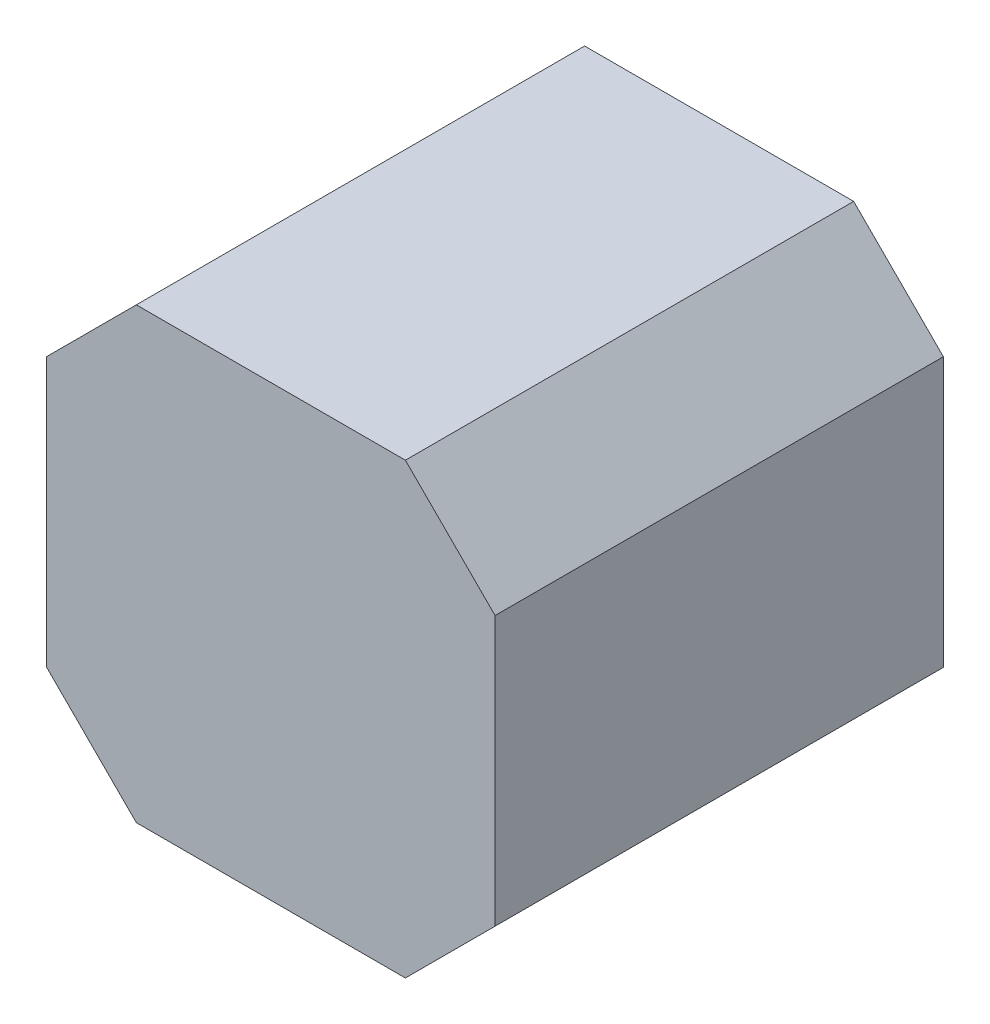
ISO-10303-21;
HEADER;
FILE_DESCRIPTION(('STEP AP214'),'2;1');
FILE_NAME('part.step','',(''),(''),'','','');
FILE_SCHEMA(('AUTOMOTIVE_DESIGN { 1 0 10303 214 1 1 1 1 }'));
ENDSEC;
DATA;
#1=APPLICATION_CONTEXT('core data for automotive mechanical design processes');
#2=APPLICATION_PROTOCOL_DEFINITION('international standard','automotive_design',2000,#1);
#3=PRODUCT_CONTEXT('',#1,'mechanical');
#4=PRODUCT('Part','Part','',(#3));
#5=PRODUCT_RELATED_PRODUCT_CATEGORY('part','',(#4));
#6=PRODUCT_DEFINITION_FORMATION('','',#4);
#7=PRODUCT_DEFINITION_CONTEXT('part definition',#1,'design');
#8=PRODUCT_DEFINITION('design','',#6,#7);
#9=PRODUCT_DEFINITION_SHAPE('','',#8);
#10=(LENGTH_UNIT() NAMED_UNIT(*) SI_UNIT(.MILLI.,.METRE.));
#11=(NAMED_UNIT(*) PLANE_ANGLE_UNIT() SI_UNIT($,.RADIAN.));
#12=(NAMED_UNIT(*) SI_UNIT($,.STERADIAN.) SOLID_ANGLE_UNIT());
#13=UNCERTAINTY_MEASURE_WITH_UNIT(LENGTH_MEASURE(1.E-05),#10,'distance_accuracy_value','');
#14=(GEOMETRIC_REPRESENTATION_CONTEXT(3) GLOBAL_UNCERTAINTY_ASSIGNED_CONTEXT((#13)) GLOBAL_UNIT_ASSIGNED_CONTEXT((#10,
#11,#12)) REPRESENTATION_CONTEXT('',''));
#15=CARTESIAN_POINT('',(0.,0.,0.));
#16=DIRECTION('',(0.,0.,1.));
#17=DIRECTION('',(1.,0.,0.));
#18=AXIS2_PLACEMENT_3D('',#15,#16,#17);
#19=CARTESIAN_POINT('',(-1.270508,-0.7622286,0.));
#20=DIRECTION('',(-1.,0.,0.));
#21=DIRECTION('',(0.,0.,1.));
#22=AXIS2_PLACEMENT_3D('',#19,#20,#21);
#23=PLANE('',#22);
#24=DIRECTION('',(0.,0.,1.));
#25=VECTOR('',#24,1.);
#26=CARTESIAN_POINT('',(-1.270508,0.76218796,0.));
#27=LINE('',#26,#25);
#28=CARTESIAN_POINT('',(-1.270508,0.76218796,0.));
#29=VERTEX_POINT('',#28);
#30=CARTESIAN_POINT('',(-1.270508,0.76218796,2.54));
#31=VERTEX_POINT('',#30);
#32=EDGE_CURVE('E159',#29,#31,#27,.T.);
#33=ORIENTED_EDGE('',*,*,#32,.F.);
#34=DIRECTION('',(0.,1.,0.));
#35=VECTOR('',#34,1.);
#36=CARTESIAN_POINT('',(-1.270508,-0.7622286,0.));
#37=LINE('',#36,#35);
#38=CARTESIAN_POINT('',(-1.270508,-0.7622286,0.));
#39=VERTEX_POINT('',#38);
#40=EDGE_CURVE('E92',#29,#39,#37,.F.);
#41=ORIENTED_EDGE('',*,*,#40,.T.);
#42=DIRECTION('',(0.,0.,1.));
#43=VECTOR('',#42,1.);
#44=CARTESIAN_POINT('',(-1.270508,-0.7622286,0.));
#45=LINE('',#44,#43);
#46=CARTESIAN_POINT('',(-1.270508,-0.7622286,2.54));
#47=VERTEX_POINT('',#46);
#48=EDGE_CURVE('E78',#47,#39,#45,.F.);
#49=ORIENTED_EDGE('',*,*,#48,.F.);
#50=DIRECTION('',(0.,1.,0.));
#51=VECTOR('',#50,1.);
#52=CARTESIAN_POINT('',(-1.270508,-0.7622286,2.54));
#53=LINE('',#52,#51);
#54=EDGE_CURVE('E68',#47,#31,#53,.T.);
#55=ORIENTED_EDGE('',*,*,#54,.T.);
#56=EDGE_LOOP('',(#33,#41,#49,#55));
#57=FACE_BOUND('',#56,.T.);
#58=ADVANCED_FACE('F17',(#57),#23,.T.);
#59=CARTESIAN_POINT('',(-1.270508,0.76218796,0.));
#60=DIRECTION('',(-0.707106781186548,0.707106781186548,0.));
#61=DIRECTION('',(-0.707106781186548,-0.707106781186548,0.));
#62=AXIS2_PLACEMENT_3D('',#59,#60,#61);
#63=PLANE('',#62);
#64=DIRECTION('',(0.,0.,1.));
#65=VECTOR('',#64,1.);
#66=CARTESIAN_POINT('',(-0.76220828,1.27048768,0.));
#67=LINE('',#66,#65);
#68=CARTESIAN_POINT('',(-0.76220828,1.27048768,0.));
#69=VERTEX_POINT('',#68);
#70=CARTESIAN_POINT('',(-0.76220828,1.27048768,2.54));
#71=VERTEX_POINT('',#70);
#72=EDGE_CURVE('E96',#69,#71,#67,.T.);
#73=ORIENTED_EDGE('',*,*,#72,.F.);
#74=DIRECTION('',(-0.707106781186548,-0.707106781186548,0.));
#75=VECTOR('',#74,1.);
#76=CARTESIAN_POINT('',(-1.270508,0.76218796,0.));
#77=LINE('',#76,#75);
#78=EDGE_CURVE('E85',#69,#29,#77,.T.);
#79=ORIENTED_EDGE('',*,*,#78,.T.);
#80=ORIENTED_EDGE('',*,*,#32,.T.);
#81=DIRECTION('',(-0.707106781186548,-0.707106781186548,0.));
#82=VECTOR('',#81,1.);
#83=CARTESIAN_POINT('',(-1.270508,0.76218796,2.54));
#84=LINE('',#83,#82);
#85=EDGE_CURVE('E91',#31,#71,#84,.F.);
#86=ORIENTED_EDGE('',*,*,#85,.T.);
#87=EDGE_LOOP('',(#73,#79,#80,#86));
#88=FACE_BOUND('',#87,.T.);
#89=ADVANCED_FACE('F169',(#88),#63,.T.);
#90=CARTESIAN_POINT('',(-0.76220828,-1.27052832,0.));
#91=DIRECTION('',(-0.707106781186548,-0.707106781186548,0.));
#92=DIRECTION('',(0.707106781186548,-0.707106781186548,0.));
#93=AXIS2_PLACEMENT_3D('',#90,#91,#92);
#94=PLANE('',#93);
#95=ORIENTED_EDGE('',*,*,#48,.T.);
#96=DIRECTION('',(0.707106781186548,-0.707106781186548,0.));
#97=VECTOR('',#96,1.);
#98=CARTESIAN_POINT('',(-0.76220828,-1.27052832,0.));
#99=LINE('',#98,#97);
#100=CARTESIAN_POINT('',(-0.76220828,-1.27052832,0.));
#101=VERTEX_POINT('',#100);
#102=EDGE_CURVE('E94',#39,#101,#99,.T.);
#103=ORIENTED_EDGE('',*,*,#102,.T.);
#104=DIRECTION('',(0.,0.,-1.));
#105=VECTOR('',#104,1.);
#106=CARTESIAN_POINT('',(-0.76220828,-1.27052832,0.));
#107=LINE('',#106,#105);
#108=CARTESIAN_POINT('',(-0.76220828,-1.27052832,2.54));
#109=VERTEX_POINT('',#108);
#110=EDGE_CURVE('E81',#109,#101,#107,.T.);
#111=ORIENTED_EDGE('',*,*,#110,.F.);
#112=DIRECTION('',(0.707106781186548,-0.707106781186548,0.));
#113=VECTOR('',#112,1.);
#114=CARTESIAN_POINT('',(-0.76220828,-1.27052832,2.54));
#115=LINE('',#114,#113);
#116=EDGE_CURVE('E75',#109,#47,#115,.F.);
#117=ORIENTED_EDGE('',*,*,#116,.T.);
#118=EDGE_LOOP('',(#95,#103,#111,#117));
#119=FACE_BOUND('',#118,.T.);
#120=ADVANCED_FACE('F76',(#119),#94,.T.);
#121=CARTESIAN_POINT('',(-0.76220828,1.27048768,0.));
#122=DIRECTION('',(7.83026645502871E-05,0.999999996934346,0.));
#123=DIRECTION('',(-0.999999996934346,7.83026645502871E-05,0.));
#124=AXIS2_PLACEMENT_3D('',#121,#122,#123);
#125=PLANE('',#124);
#126=DIRECTION('',(0.,0.,1.));
#127=VECTOR('',#126,1.);
#128=CARTESIAN_POINT('',(0.762327655226297,1.2703683047737,0.));
#129=LINE('',#128,#127);
#130=CARTESIAN_POINT('',(0.762343707192333,1.27034585939998,0.));
#131=VERTEX_POINT('',#130);
#132=CARTESIAN_POINT('',(0.762343707192333,1.27034585939998,2.54));
#133=VERTEX_POINT('',#132);
#134=EDGE_CURVE('E106',#131,#133,#129,.T.);
#135=ORIENTED_EDGE('',*,*,#134,.F.);
#136=DIRECTION('',(-0.999999996934346,7.83026645502871E-05,0.));
#137=VECTOR('',#136,1.);
#138=CARTESIAN_POINT('',(-0.76220828,1.27048768,0.));
#139=LINE('',#138,#137);
#140=EDGE_CURVE('E122',#131,#69,#139,.T.);
#141=ORIENTED_EDGE('',*,*,#140,.T.);
#142=ORIENTED_EDGE('',*,*,#72,.T.);
#143=DIRECTION('',(-0.999999996934346,7.83026645502871E-05,0.));
#144=VECTOR('',#143,1.);
#145=CARTESIAN_POINT('',(-0.76220828,1.27048768,2.54));
#146=LINE('',#145,#144);
#147=EDGE_CURVE('E144',#71,#133,#146,.F.);
#148=ORIENTED_EDGE('',*,*,#147,.T.);
#149=EDGE_LOOP('',(#135,#141,#142,#148));
#150=FACE_BOUND('',#149,.T.);
#151=ADVANCED_FACE('F172',(#150),#125,.T.);
#152=CARTESIAN_POINT('',(0.76220828,-1.27052832,0.));
#153=DIRECTION('',(0.,-1.,0.));
#154=DIRECTION('',(0.,0.,-1.));
#155=AXIS2_PLACEMENT_3D('',#152,#153,#154);
#156=PLANE('',#155);
#157=ORIENTED_EDGE('',*,*,#110,.T.);
#158=DIRECTION('',(1.,0.,0.));
#159=VECTOR('',#158,1.);
#160=CARTESIAN_POINT('',(0.76220828,-1.27052832,0.));
#161=LINE('',#160,#159);
#162=CARTESIAN_POINT('',(0.76220828,-1.27052832,0.));
#163=VERTEX_POINT('',#162);
#164=EDGE_CURVE('E108',#101,#163,#161,.T.);
#165=ORIENTED_EDGE('',*,*,#164,.T.);
#166=DIRECTION('',(0.,0.,1.));
#167=VECTOR('',#166,1.);
#168=CARTESIAN_POINT('',(0.76220828,-1.27052832,0.));
#169=LINE('',#168,#167);
#170=CARTESIAN_POINT('',(0.76220828,-1.27052832,2.54));
#171=VERTEX_POINT('',#170);
#172=EDGE_CURVE('E178',#171,#163,#169,.F.);
#173=ORIENTED_EDGE('',*,*,#172,.F.);
#174=DIRECTION('',(1.,0.,0.));
#175=VECTOR('',#174,1.);
#176=CARTESIAN_POINT('',(0.76238608,-1.27052832,2.54));
#177=LINE('',#176,#175);
#178=EDGE_CURVE('E113',#109,#171,#177,.T.);
#179=ORIENTED_EDGE('',*,*,#178,.F.);
#180=EDGE_LOOP('',(#157,#165,#173,#179));
#181=FACE_BOUND('',#180,.T.);
#182=ADVANCED_FACE('F193',(#181),#156,.T.);
#183=CARTESIAN_POINT('',(0.76238608,1.27030988,0.));
#184=DIRECTION('',(0.707106781186548,0.707106781186548,0.));
#185=DIRECTION('',(-0.707106781186548,0.707106781186548,0.));
#186=AXIS2_PLACEMENT_3D('',#183,#184,#185);
#187=PLANE('',#186);
#188=DIRECTION('',(0.,0.,-1.));
#189=VECTOR('',#188,1.);
#190=CARTESIAN_POINT('',(1.270508,0.76218796,0.));
#191=LINE('',#190,#189);
#192=CARTESIAN_POINT('',(1.270508,0.76218796,0.));
#193=VERTEX_POINT('',#192);
#194=CARTESIAN_POINT('',(1.270508,0.76218796,2.54));
#195=VERTEX_POINT('',#194);
#196=EDGE_CURVE('E127',#193,#195,#191,.F.);
#197=ORIENTED_EDGE('',*,*,#196,.F.);
#198=DIRECTION('',(-0.707106781186548,0.707106781186548,0.));
#199=VECTOR('',#198,1.);
#200=CARTESIAN_POINT('',(0.76238608,1.27030988,0.));
#201=LINE('',#200,#199);
#202=EDGE_CURVE('E35',#193,#131,#201,.T.);
#203=ORIENTED_EDGE('',*,*,#202,.T.);
#204=ORIENTED_EDGE('',*,*,#134,.T.);
#205=DIRECTION('',(-0.707106781186548,0.707106781186547,0.));
#206=VECTOR('',#205,1.);
#207=CARTESIAN_POINT('',(1.270508,0.76218796,2.54));
#208=LINE('',#207,#206);
#209=EDGE_CURVE('E173',#195,#133,#208,.T.);
#210=ORIENTED_EDGE('',*,*,#209,.F.);
#211=EDGE_LOOP('',(#197,#203,#204,#210));
#212=FACE_BOUND('',#211,.T.);
#213=ADVANCED_FACE('F197',(#212),#187,.T.);
#214=CARTESIAN_POINT('',(0.76238608,1.27030988,2.54));
#215=DIRECTION('',(0.,0.,1.));
#216=DIRECTION('',(1.,0.,0.));
#217=AXIS2_PLACEMENT_3D('',#214,#215,#216);
#218=PLANE('',#217);
#219=DIRECTION('',(0.,1.,0.));
#220=VECTOR('',#219,1.);
#221=CARTESIAN_POINT('',(1.270508,0.76218796,2.54));
#222=LINE('',#221,#220);
#223=CARTESIAN_POINT('',(1.270508,-0.7622286,2.54));
#224=VERTEX_POINT('',#223);
#225=EDGE_CURVE('E130',#195,#224,#222,.F.);
#226=ORIENTED_EDGE('',*,*,#225,.F.);
#227=ORIENTED_EDGE('',*,*,#209,.T.);
#228=ORIENTED_EDGE('',*,*,#147,.F.);
#229=ORIENTED_EDGE('',*,*,#85,.F.);
#230=ORIENTED_EDGE('',*,*,#54,.F.);
#231=ORIENTED_EDGE('',*,*,#116,.F.);
#232=ORIENTED_EDGE('',*,*,#178,.T.);
#233=DIRECTION('',(0.707106781186548,0.707106781186548,0.));
#234=VECTOR('',#233,1.);
#235=CARTESIAN_POINT('',(1.270508,-0.7622286,2.54));
#236=LINE('',#235,#234);
#237=EDGE_CURVE('E175',#224,#171,#236,.F.);
#238=ORIENTED_EDGE('',*,*,#237,.F.);
#239=EDGE_LOOP('',(#226,#227,#228,#229,#230,#231,#232,#238));
#240=FACE_BOUND('',#239,.T.);
#241=ADVANCED_FACE('F89',(#240),#218,.T.);
#242=CARTESIAN_POINT('',(1.270508,-0.7622286,0.));
#243=DIRECTION('',(0.707106781186548,-0.707106781186548,0.));
#244=DIRECTION('',(0.707106781186548,0.707106781186548,0.));
#245=AXIS2_PLACEMENT_3D('',#242,#243,#244);
#246=PLANE('',#245);
#247=ORIENTED_EDGE('',*,*,#172,.T.);
#248=DIRECTION('',(0.707106781186548,0.707106781186548,0.));
#249=VECTOR('',#248,1.);
#250=CARTESIAN_POINT('',(1.270508,-0.7622286,0.));
#251=LINE('',#250,#249);
#252=CARTESIAN_POINT('',(1.270508,-0.7622286,0.));
#253=VERTEX_POINT('',#252);
#254=EDGE_CURVE('E131',#163,#253,#251,.T.);
#255=ORIENTED_EDGE('',*,*,#254,.T.);
#256=DIRECTION('',(0.,0.,-1.));
#257=VECTOR('',#256,1.);
#258=CARTESIAN_POINT('',(1.270508,-0.7622286,0.));
#259=LINE('',#258,#257);
#260=EDGE_CURVE('E26',#224,#253,#259,.T.);
#261=ORIENTED_EDGE('',*,*,#260,.F.);
#262=ORIENTED_EDGE('',*,*,#237,.T.);
#263=EDGE_LOOP('',(#247,#255,#261,#262));
#264=FACE_BOUND('',#263,.T.);
#265=ADVANCED_FACE('F192',(#264),#246,.T.);
#266=CARTESIAN_POINT('',(1.270508,0.76218796,0.));
#267=DIRECTION('',(1.,0.,0.));
#268=DIRECTION('',(0.,0.,-1.));
#269=AXIS2_PLACEMENT_3D('',#266,#267,#268);
#270=PLANE('',#269);
#271=ORIENTED_EDGE('',*,*,#260,.T.);
#272=DIRECTION('',(0.,1.,0.));
#273=VECTOR('',#272,1.);
#274=CARTESIAN_POINT('',(1.270508,1.27030988,0.));
#275=LINE('',#274,#273);
#276=EDGE_CURVE('E11',#253,#193,#275,.T.);
#277=ORIENTED_EDGE('',*,*,#276,.T.);
#278=ORIENTED_EDGE('',*,*,#196,.T.);
#279=ORIENTED_EDGE('',*,*,#225,.T.);
#280=EDGE_LOOP('',(#271,#277,#278,#279));
#281=FACE_BOUND('',#280,.T.);
#282=ADVANCED_FACE('F187',(#281),#270,.T.);
#283=CARTESIAN_POINT('',(0.76238608,1.27030988,0.));
#284=DIRECTION('',(0.,0.,1.));
#285=DIRECTION('',(1.,0.,0.));
#286=AXIS2_PLACEMENT_3D('',#283,#284,#285);
#287=PLANE('',#286);
#288=ORIENTED_EDGE('',*,*,#276,.F.);
#289=ORIENTED_EDGE('',*,*,#254,.F.);
#290=ORIENTED_EDGE('',*,*,#164,.F.);
#291=ORIENTED_EDGE('',*,*,#102,.F.);
#292=ORIENTED_EDGE('',*,*,#40,.F.);
#293=ORIENTED_EDGE('',*,*,#78,.F.);
#294=ORIENTED_EDGE('',*,*,#140,.F.);
#295=ORIENTED_EDGE('',*,*,#202,.F.);
#296=EDGE_LOOP('',(#288,#289,#290,#291,#292,#293,#294,#295));
#297=FACE_BOUND('',#296,.T.);
#298=ADVANCED_FACE('F170',(#297),#287,.F.);
#299=CLOSED_SHELL('',(#58,#89,#120,#151,#182,#213,#241,#265,#282,#298));
#300=MANIFOLD_SOLID_BREP('B1',#299);
#301=ADVANCED_BREP_SHAPE_REPRESENTATION('',(#18,#300),#14);
#302=SHAPE_DEFINITION_REPRESENTATION(#9,#301);
ENDSEC;
END-ISO-10303-21;
